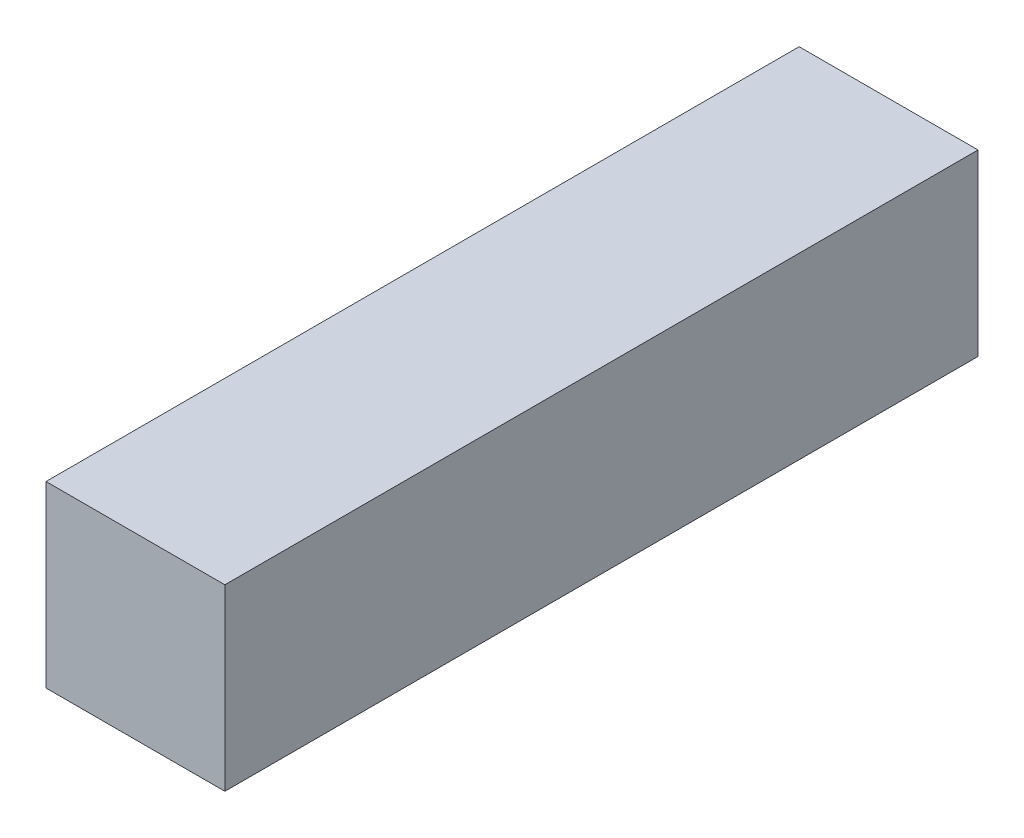
ISO-10303-21;
HEADER;
FILE_DESCRIPTION(('STEP AP214'),'2;1');
FILE_NAME('part.step','',(''),(''),'','','');
FILE_SCHEMA(('AUTOMOTIVE_DESIGN { 1 0 10303 214 1 1 1 1 }'));
ENDSEC;
DATA;
#1=APPLICATION_CONTEXT('core data for automotive mechanical design processes');
#2=APPLICATION_PROTOCOL_DEFINITION('international standard','automotive_design',2000,#1);
#3=PRODUCT_CONTEXT('',#1,'mechanical');
#4=PRODUCT('Part','Part','',(#3));
#5=PRODUCT_RELATED_PRODUCT_CATEGORY('part','',(#4));
#6=PRODUCT_DEFINITION_FORMATION('','',#4);
#7=PRODUCT_DEFINITION_CONTEXT('part definition',#1,'design');
#8=PRODUCT_DEFINITION('design','',#6,#7);
#9=PRODUCT_DEFINITION_SHAPE('','',#8);
#10=(LENGTH_UNIT() NAMED_UNIT(*) SI_UNIT(.MILLI.,.METRE.));
#11=(NAMED_UNIT(*) PLANE_ANGLE_UNIT() SI_UNIT($,.RADIAN.));
#12=(NAMED_UNIT(*) SI_UNIT($,.STERADIAN.) SOLID_ANGLE_UNIT());
#13=UNCERTAINTY_MEASURE_WITH_UNIT(LENGTH_MEASURE(1.E-05),#10,'distance_accuracy_value','');
#14=(GEOMETRIC_REPRESENTATION_CONTEXT(3) GLOBAL_UNCERTAINTY_ASSIGNED_CONTEXT((#13)) GLOBAL_UNIT_ASSIGNED_CONTEXT((#10,
#11,#12)) REPRESENTATION_CONTEXT('',''));
#15=CARTESIAN_POINT('',(0.,0.,0.));
#16=DIRECTION('',(0.,0.,1.));
#17=DIRECTION('',(1.,0.,0.));
#18=AXIS2_PLACEMENT_3D('',#15,#16,#17);
#19=CARTESIAN_POINT('',(9.5,-9.5,80.));
#20=DIRECTION('',(-1.,0.,0.));
#21=DIRECTION('',(0.,0.,1.));
#22=AXIS2_PLACEMENT_3D('',#19,#20,#21);
#23=PLANE('',#22);
#24=DIRECTION('',(0.,1.,0.));
#25=VECTOR('',#24,1.);
#26=CARTESIAN_POINT('',(9.5,-9.5,0.));
#27=LINE('',#26,#25);
#28=CARTESIAN_POINT('',(9.5,-9.5,0.));
#29=VERTEX_POINT('',#28);
#30=CARTESIAN_POINT('',(9.5,9.5,0.));
#31=VERTEX_POINT('',#30);
#32=EDGE_CURVE('E94',#29,#31,#27,.T.);
#33=ORIENTED_EDGE('',*,*,#32,.T.);
#34=DIRECTION('',(0.,0.,-1.));
#35=VECTOR('',#34,1.);
#36=CARTESIAN_POINT('',(9.5,9.5,80.));
#37=LINE('',#36,#35);
#38=CARTESIAN_POINT('',(9.5,9.5,80.));
#39=VERTEX_POINT('',#38);
#40=EDGE_CURVE('E11',#39,#31,#37,.T.);
#41=ORIENTED_EDGE('',*,*,#40,.F.);
#42=DIRECTION('',(0.,1.,0.));
#43=VECTOR('',#42,1.);
#44=CARTESIAN_POINT('',(9.5,-9.5,80.));
#45=LINE('',#44,#43);
#46=CARTESIAN_POINT('',(9.5,-9.5,80.));
#47=VERTEX_POINT('',#46);
#48=EDGE_CURVE('E82',#47,#39,#45,.T.);
#49=ORIENTED_EDGE('',*,*,#48,.F.);
#50=DIRECTION('',(0.,0.,-1.));
#51=VECTOR('',#50,1.);
#52=CARTESIAN_POINT('',(9.5,-9.5,80.));
#53=LINE('',#52,#51);
#54=EDGE_CURVE('E90',#47,#29,#53,.T.);
#55=ORIENTED_EDGE('',*,*,#54,.T.);
#56=EDGE_LOOP('',(#33,#41,#49,#55));
#57=FACE_BOUND('',#56,.T.);
#58=ADVANCED_FACE('F31',(#57),#23,.F.);
#59=CARTESIAN_POINT('',(-9.5,9.5,80.));
#60=DIRECTION('',(0.,-1.,0.));
#61=DIRECTION('',(0.,0.,-1.));
#62=AXIS2_PLACEMENT_3D('',#59,#60,#61);
#63=PLANE('',#62);
#64=DIRECTION('',(-1.,0.,0.));
#65=VECTOR('',#64,1.);
#66=CARTESIAN_POINT('',(-9.5,9.5,0.));
#67=LINE('',#66,#65);
#68=CARTESIAN_POINT('',(-9.5,9.5,0.));
#69=VERTEX_POINT('',#68);
#70=EDGE_CURVE('E86',#31,#69,#67,.T.);
#71=ORIENTED_EDGE('',*,*,#70,.T.);
#72=DIRECTION('',(0.,0.,-1.));
#73=VECTOR('',#72,1.);
#74=CARTESIAN_POINT('',(-9.5,9.5,80.));
#75=LINE('',#74,#73);
#76=CARTESIAN_POINT('',(-9.5,9.5,80.));
#77=VERTEX_POINT('',#76);
#78=EDGE_CURVE('E39',#77,#69,#75,.T.);
#79=ORIENTED_EDGE('',*,*,#78,.F.);
#80=DIRECTION('',(-1.,0.,0.));
#81=VECTOR('',#80,1.);
#82=CARTESIAN_POINT('',(-9.5,9.5,80.));
#83=LINE('',#82,#81);
#84=EDGE_CURVE('E77',#39,#77,#83,.T.);
#85=ORIENTED_EDGE('',*,*,#84,.F.);
#86=ORIENTED_EDGE('',*,*,#40,.T.);
#87=EDGE_LOOP('',(#71,#79,#85,#86));
#88=FACE_BOUND('',#87,.T.);
#89=ADVANCED_FACE('F85',(#88),#63,.F.);
#90=CARTESIAN_POINT('',(-9.5,-9.5,80.));
#91=DIRECTION('',(1.,0.,0.));
#92=DIRECTION('',(0.,0.,-1.));
#93=AXIS2_PLACEMENT_3D('',#90,#91,#92);
#94=PLANE('',#93);
#95=DIRECTION('',(0.,-1.,0.));
#96=VECTOR('',#95,1.);
#97=CARTESIAN_POINT('',(-9.5,-9.5,0.));
#98=LINE('',#97,#96);
#99=CARTESIAN_POINT('',(-9.5,-9.5,0.));
#100=VERTEX_POINT('',#99);
#101=EDGE_CURVE('E64',#69,#100,#98,.T.);
#102=ORIENTED_EDGE('',*,*,#101,.T.);
#103=DIRECTION('',(0.,0.,-1.));
#104=VECTOR('',#103,1.);
#105=CARTESIAN_POINT('',(-9.5,-9.5,80.));
#106=LINE('',#105,#104);
#107=CARTESIAN_POINT('',(-9.5,-9.5,80.));
#108=VERTEX_POINT('',#107);
#109=EDGE_CURVE('E87',#108,#100,#106,.T.);
#110=ORIENTED_EDGE('',*,*,#109,.F.);
#111=DIRECTION('',(0.,-1.,0.));
#112=VECTOR('',#111,1.);
#113=CARTESIAN_POINT('',(-9.5,-9.5,80.));
#114=LINE('',#113,#112);
#115=EDGE_CURVE('E80',#77,#108,#114,.T.);
#116=ORIENTED_EDGE('',*,*,#115,.F.);
#117=ORIENTED_EDGE('',*,*,#78,.T.);
#118=EDGE_LOOP('',(#102,#110,#116,#117));
#119=FACE_BOUND('',#118,.T.);
#120=ADVANCED_FACE('F88',(#119),#94,.F.);
#121=CARTESIAN_POINT('',(-9.5,-9.5,80.));
#122=DIRECTION('',(0.,1.,0.));
#123=DIRECTION('',(0.,0.,1.));
#124=AXIS2_PLACEMENT_3D('',#121,#122,#123);
#125=PLANE('',#124);
#126=DIRECTION('',(1.,0.,0.));
#127=VECTOR('',#126,1.);
#128=CARTESIAN_POINT('',(-9.5,-9.5,0.));
#129=LINE('',#128,#127);
#130=EDGE_CURVE('E70',#100,#29,#129,.T.);
#131=ORIENTED_EDGE('',*,*,#130,.T.);
#132=ORIENTED_EDGE('',*,*,#54,.F.);
#133=DIRECTION('',(1.,0.,0.));
#134=VECTOR('',#133,1.);
#135=CARTESIAN_POINT('',(-9.5,-9.5,80.));
#136=LINE('',#135,#134);
#137=EDGE_CURVE('E47',#108,#47,#136,.T.);
#138=ORIENTED_EDGE('',*,*,#137,.F.);
#139=ORIENTED_EDGE('',*,*,#109,.T.);
#140=EDGE_LOOP('',(#131,#132,#138,#139));
#141=FACE_BOUND('',#140,.T.);
#142=ADVANCED_FACE('F101',(#141),#125,.F.);
#143=CARTESIAN_POINT('',(9.5,9.5,80.));
#144=DIRECTION('',(0.,0.,-1.));
#145=DIRECTION('',(-1.,0.,0.));
#146=AXIS2_PLACEMENT_3D('',#143,#144,#145);
#147=PLANE('',#146);
#148=ORIENTED_EDGE('',*,*,#48,.T.);
#149=ORIENTED_EDGE('',*,*,#84,.T.);
#150=ORIENTED_EDGE('',*,*,#115,.T.);
#151=ORIENTED_EDGE('',*,*,#137,.T.);
#152=EDGE_LOOP('',(#148,#149,#150,#151));
#153=FACE_BOUND('',#152,.T.);
#154=ADVANCED_FACE('F78',(#153),#147,.F.);
#155=CARTESIAN_POINT('',(9.5,9.5,0.));
#156=DIRECTION('',(0.,0.,-1.));
#157=DIRECTION('',(-1.,0.,0.));
#158=AXIS2_PLACEMENT_3D('',#155,#156,#157);
#159=PLANE('',#158);
#160=ORIENTED_EDGE('',*,*,#32,.F.);
#161=ORIENTED_EDGE('',*,*,#130,.F.);
#162=ORIENTED_EDGE('',*,*,#101,.F.);
#163=ORIENTED_EDGE('',*,*,#70,.F.);
#164=EDGE_LOOP('',(#160,#161,#162,#163));
#165=FACE_BOUND('',#164,.T.);
#166=ADVANCED_FACE('F104',(#165),#159,.T.);
#167=CLOSED_SHELL('',(#58,#89,#120,#142,#154,#166));
#168=MANIFOLD_SOLID_BREP('B2',#167);
#169=ADVANCED_BREP_SHAPE_REPRESENTATION('',(#18,#168),#14);
#170=SHAPE_DEFINITION_REPRESENTATION(#9,#169);
ENDSEC;
END-ISO-10303-21;
